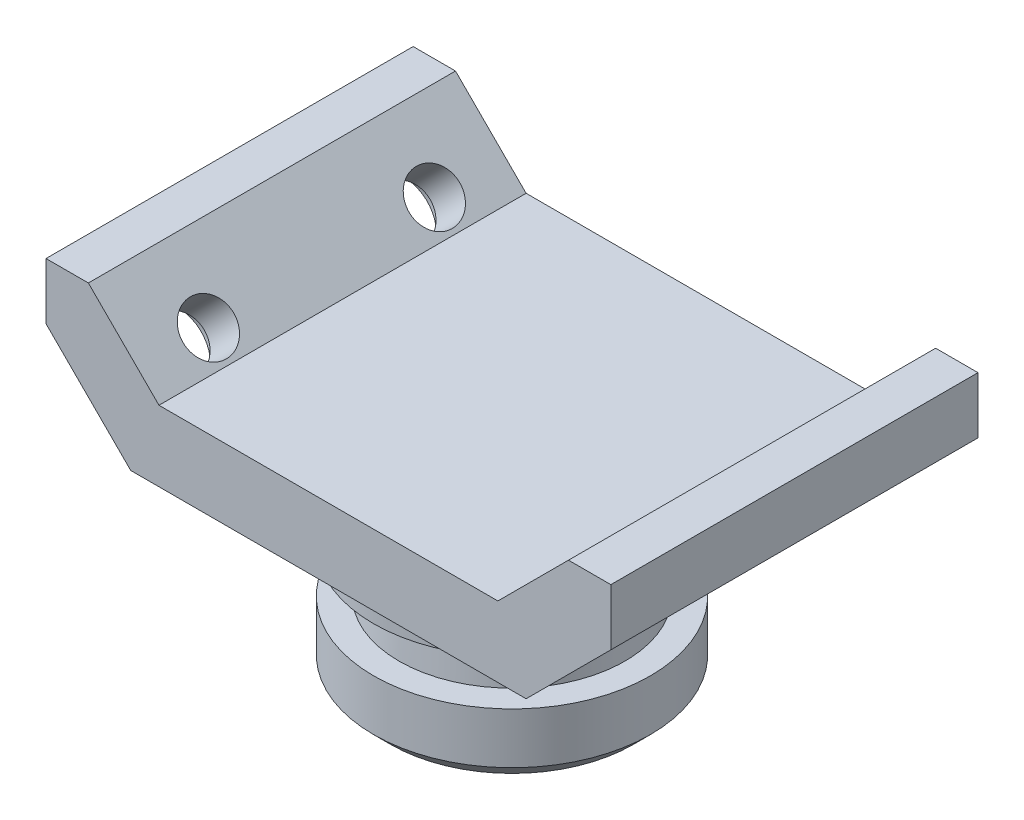
ISO-10303-21;
HEADER;
FILE_DESCRIPTION(('STEP AP214'),'2;1');
FILE_NAME('part.step','',(''),(''),'','','');
FILE_SCHEMA(('AUTOMOTIVE_DESIGN { 1 0 10303 214 1 1 1 1 }'));
ENDSEC;
DATA;
#1=APPLICATION_CONTEXT('core data for automotive mechanical design processes');
#2=APPLICATION_PROTOCOL_DEFINITION('international standard','automotive_design',2000,#1);
#3=PRODUCT_CONTEXT('',#1,'mechanical');
#4=PRODUCT('Part','Part','',(#3));
#5=PRODUCT_RELATED_PRODUCT_CATEGORY('part','',(#4));
#6=PRODUCT_DEFINITION_FORMATION('','',#4);
#7=PRODUCT_DEFINITION_CONTEXT('part definition',#1,'design');
#8=PRODUCT_DEFINITION('design','',#6,#7);
#9=PRODUCT_DEFINITION_SHAPE('','',#8);
#10=(LENGTH_UNIT() NAMED_UNIT(*) SI_UNIT(.MILLI.,.METRE.));
#11=(NAMED_UNIT(*) PLANE_ANGLE_UNIT() SI_UNIT($,.RADIAN.));
#12=(NAMED_UNIT(*) SI_UNIT($,.STERADIAN.) SOLID_ANGLE_UNIT());
#13=UNCERTAINTY_MEASURE_WITH_UNIT(LENGTH_MEASURE(1.E-05),#10,'distance_accuracy_value','');
#14=(GEOMETRIC_REPRESENTATION_CONTEXT(3) GLOBAL_UNCERTAINTY_ASSIGNED_CONTEXT((#13)) GLOBAL_UNIT_ASSIGNED_CONTEXT((#10,
#11,#12)) REPRESENTATION_CONTEXT('',''));
#15=CARTESIAN_POINT('',(0.,0.,0.));
#16=DIRECTION('',(0.,0.,1.));
#17=DIRECTION('',(1.,0.,0.));
#18=AXIS2_PLACEMENT_3D('',#15,#16,#17);
#19=CARTESIAN_POINT('',(30.,0.,32.5));
#20=DIRECTION('',(0.707106781186548,-0.707106781186547,0.));
#21=DIRECTION('',(0.707106781186547,0.707106781186548,0.));
#22=AXIS2_PLACEMENT_3D('',#19,#20,#21);
#23=PLANE('',#22);
#24=CARTESIAN_POINT('',(33.75,3.75,-20.));
#25=DIRECTION('',(0.707106781186548,-0.707106781186547,0.));
#26=DIRECTION('',(0.707106781186547,0.707106781186548,0.));
#27=AXIS2_PLACEMENT_3D('',#24,#25,#26);
#28=CIRCLE('',#27,4.49999999999999);
#29=CARTESIAN_POINT('',(36.9319805153395,6.93198051533945,-20.));
#30=VERTEX_POINT('',#29);
#31=EDGE_CURVE('E36',#30,#30,#28,.T.);
#32=ORIENTED_EDGE('',*,*,#31,.T.);
#33=EDGE_LOOP('',(#32));
#34=FACE_BOUND('',#33,.T.);
#35=CARTESIAN_POINT('',(33.75,3.75,20.));
#36=DIRECTION('',(0.707106781186548,-0.707106781186547,0.));
#37=DIRECTION('',(0.707106781186547,0.707106781186548,0.));
#38=AXIS2_PLACEMENT_3D('',#35,#36,#37);
#39=CIRCLE('',#38,4.49999999999999);
#40=CARTESIAN_POINT('',(36.9319805153395,6.93198051533945,20.));
#41=VERTEX_POINT('',#40);
#42=EDGE_CURVE('E192',#41,#41,#39,.T.);
#43=ORIENTED_EDGE('',*,*,#42,.T.);
#44=EDGE_LOOP('',(#43));
#45=FACE_BOUND('',#44,.T.);
#46=DIRECTION('',(-0.707106781186547,-0.707106781186548,0.));
#47=VECTOR('',#46,1.);
#48=CARTESIAN_POINT('',(30.,0.,-32.5));
#49=LINE('',#48,#47);
#50=CARTESIAN_POINT('',(42.5,12.5,-32.5));
#51=VERTEX_POINT('',#50);
#52=CARTESIAN_POINT('',(30.,0.,-32.5));
#53=VERTEX_POINT('',#52);
#54=EDGE_CURVE('E144',#51,#53,#49,.T.);
#55=ORIENTED_EDGE('',*,*,#54,.T.);
#56=DIRECTION('',(0.,0.,-1.));
#57=VECTOR('',#56,1.);
#58=CARTESIAN_POINT('',(30.,0.,32.5));
#59=LINE('',#58,#57);
#60=CARTESIAN_POINT('',(30.,0.,32.5));
#61=VERTEX_POINT('',#60);
#62=EDGE_CURVE('E42',#61,#53,#59,.T.);
#63=ORIENTED_EDGE('',*,*,#62,.F.);
#64=DIRECTION('',(-0.707106781186547,-0.707106781186548,0.));
#65=VECTOR('',#64,1.);
#66=CARTESIAN_POINT('',(30.,0.,32.5));
#67=LINE('',#66,#65);
#68=CARTESIAN_POINT('',(42.5,12.5,32.5));
#69=VERTEX_POINT('',#68);
#70=EDGE_CURVE('E163',#69,#61,#67,.T.);
#71=ORIENTED_EDGE('',*,*,#70,.F.);
#72=DIRECTION('',(0.,0.,-1.));
#73=VECTOR('',#72,1.);
#74=CARTESIAN_POINT('',(42.5,12.5,32.5));
#75=LINE('',#74,#73);
#76=EDGE_CURVE('E140',#69,#51,#75,.T.);
#77=ORIENTED_EDGE('',*,*,#76,.T.);
#78=EDGE_LOOP('',(#55,#63,#71,#77));
#79=FACE_BOUND('',#78,.T.);
#80=ADVANCED_FACE('F33',(#34,#45,#79),#23,.F.);
#81=CARTESIAN_POINT('',(-30.,0.,32.5));
#82=DIRECTION('',(0.,-1.,0.));
#83=DIRECTION('',(1.,0.,0.));
#84=AXIS2_PLACEMENT_3D('',#81,#82,#83);
#85=PLANE('',#84);
#86=DIRECTION('',(-1.,0.,0.));
#87=VECTOR('',#86,1.);
#88=CARTESIAN_POINT('',(-30.,0.,-32.5));
#89=LINE('',#88,#87);
#90=CARTESIAN_POINT('',(-30.,0.,-32.5));
#91=VERTEX_POINT('',#90);
#92=EDGE_CURVE('E147',#53,#91,#89,.T.);
#93=ORIENTED_EDGE('',*,*,#92,.T.);
#94=DIRECTION('',(0.,0.,-1.));
#95=VECTOR('',#94,1.);
#96=CARTESIAN_POINT('',(-30.,0.,32.5));
#97=LINE('',#96,#95);
#98=CARTESIAN_POINT('',(-30.,0.,32.5));
#99=VERTEX_POINT('',#98);
#100=EDGE_CURVE('E179',#99,#91,#97,.T.);
#101=ORIENTED_EDGE('',*,*,#100,.F.);
#102=DIRECTION('',(-1.,0.,0.));
#103=VECTOR('',#102,1.);
#104=CARTESIAN_POINT('',(-30.,0.,32.5));
#105=LINE('',#104,#103);
#106=EDGE_CURVE('E101',#61,#99,#105,.T.);
#107=ORIENTED_EDGE('',*,*,#106,.F.);
#108=ORIENTED_EDGE('',*,*,#62,.T.);
#109=EDGE_LOOP('',(#93,#101,#107,#108));
#110=FACE_BOUND('',#109,.T.);
#111=ADVANCED_FACE('F275',(#110),#85,.F.);
#112=CARTESIAN_POINT('',(-30.,0.,32.5));
#113=DIRECTION('',(-0.707106781186547,-0.707106781186548,0.));
#114=DIRECTION('',(0.707106781186548,-0.707106781186547,0.));
#115=AXIS2_PLACEMENT_3D('',#112,#113,#114);
#116=PLANE('',#115);
#117=CARTESIAN_POINT('',(-33.75,3.74999999999999,-20.));
#118=DIRECTION('',(-0.707106781186547,-0.707106781186548,0.));
#119=DIRECTION('',(0.707106781186548,-0.707106781186547,0.));
#120=AXIS2_PLACEMENT_3D('',#117,#118,#119);
#121=CIRCLE('',#120,4.49999999999999);
#122=CARTESIAN_POINT('',(-30.5680194846605,0.568019484660539,-20.));
#123=VERTEX_POINT('',#122);
#124=EDGE_CURVE('E188',#123,#123,#121,.T.);
#125=ORIENTED_EDGE('',*,*,#124,.T.);
#126=EDGE_LOOP('',(#125));
#127=FACE_BOUND('',#126,.T.);
#128=CARTESIAN_POINT('',(-33.75,3.74999999999999,20.));
#129=DIRECTION('',(-0.707106781186547,-0.707106781186548,0.));
#130=DIRECTION('',(0.707106781186548,-0.707106781186547,0.));
#131=AXIS2_PLACEMENT_3D('',#128,#129,#130);
#132=CIRCLE('',#131,4.49999999999999);
#133=CARTESIAN_POINT('',(-30.5680194846605,0.568019484660539,20.));
#134=VERTEX_POINT('',#133);
#135=EDGE_CURVE('E183',#134,#134,#132,.T.);
#136=ORIENTED_EDGE('',*,*,#135,.T.);
#137=EDGE_LOOP('',(#136));
#138=FACE_BOUND('',#137,.T.);
#139=DIRECTION('',(-0.707106781186547,0.707106781186547,0.));
#140=VECTOR('',#139,1.);
#141=CARTESIAN_POINT('',(-30.,0.,-32.5));
#142=LINE('',#141,#140);
#143=CARTESIAN_POINT('',(-42.5,12.5,-32.5));
#144=VERTEX_POINT('',#143);
#145=EDGE_CURVE('E150',#91,#144,#142,.T.);
#146=ORIENTED_EDGE('',*,*,#145,.T.);
#147=DIRECTION('',(0.,0.,-1.));
#148=VECTOR('',#147,1.);
#149=CARTESIAN_POINT('',(-42.5,12.5,32.5));
#150=LINE('',#149,#148);
#151=CARTESIAN_POINT('',(-42.5,12.5,32.5));
#152=VERTEX_POINT('',#151);
#153=EDGE_CURVE('E176',#152,#144,#150,.T.);
#154=ORIENTED_EDGE('',*,*,#153,.F.);
#155=DIRECTION('',(-0.707106781186547,0.707106781186547,0.));
#156=VECTOR('',#155,1.);
#157=CARTESIAN_POINT('',(-30.,0.,32.5));
#158=LINE('',#157,#156);
#159=EDGE_CURVE('E240',#99,#152,#158,.T.);
#160=ORIENTED_EDGE('',*,*,#159,.F.);
#161=ORIENTED_EDGE('',*,*,#100,.T.);
#162=EDGE_LOOP('',(#146,#154,#160,#161));
#163=FACE_BOUND('',#162,.T.);
#164=ADVANCED_FACE('F280',(#127,#138,#163),#116,.F.);
#165=CARTESIAN_POINT('',(-42.5,12.5,32.5));
#166=DIRECTION('',(0.,-1.,0.));
#167=DIRECTION('',(1.,0.,0.));
#168=AXIS2_PLACEMENT_3D('',#165,#166,#167);
#169=PLANE('',#168);
#170=DIRECTION('',(-1.,0.,0.));
#171=VECTOR('',#170,1.);
#172=CARTESIAN_POINT('',(-42.5,12.5,-32.5));
#173=LINE('',#172,#171);
#174=CARTESIAN_POINT('',(-50.,12.5,-32.5));
#175=VERTEX_POINT('',#174);
#176=EDGE_CURVE('E152',#144,#175,#173,.T.);
#177=ORIENTED_EDGE('',*,*,#176,.T.);
#178=DIRECTION('',(0.,0.,-1.));
#179=VECTOR('',#178,1.);
#180=CARTESIAN_POINT('',(-50.,12.5,32.5));
#181=LINE('',#180,#179);
#182=CARTESIAN_POINT('',(-50.,12.5,32.5));
#183=VERTEX_POINT('',#182);
#184=EDGE_CURVE('E173',#183,#175,#181,.T.);
#185=ORIENTED_EDGE('',*,*,#184,.F.);
#186=DIRECTION('',(-1.,0.,0.));
#187=VECTOR('',#186,1.);
#188=CARTESIAN_POINT('',(-42.5,12.5,32.5));
#189=LINE('',#188,#187);
#190=EDGE_CURVE('E242',#152,#183,#189,.T.);
#191=ORIENTED_EDGE('',*,*,#190,.F.);
#192=ORIENTED_EDGE('',*,*,#153,.T.);
#193=EDGE_LOOP('',(#177,#185,#191,#192));
#194=FACE_BOUND('',#193,.T.);
#195=ADVANCED_FACE('F546',(#194),#169,.F.);
#196=CARTESIAN_POINT('',(-50.,12.5,32.5));
#197=DIRECTION('',(1.,0.,0.));
#198=DIRECTION('',(0.,1.,0.));
#199=AXIS2_PLACEMENT_3D('',#196,#197,#198);
#200=PLANE('',#199);
#201=DIRECTION('',(0.,-1.,0.));
#202=VECTOR('',#201,1.);
#203=CARTESIAN_POINT('',(-50.,12.5,-32.5));
#204=LINE('',#203,#202);
#205=CARTESIAN_POINT('',(-50.,2.49999999999996,-32.5));
#206=VERTEX_POINT('',#205);
#207=EDGE_CURVE('E154',#175,#206,#204,.T.);
#208=ORIENTED_EDGE('',*,*,#207,.T.);
#209=DIRECTION('',(0.,0.,-1.));
#210=VECTOR('',#209,1.);
#211=CARTESIAN_POINT('',(-50.,2.49999999999996,32.5));
#212=LINE('',#211,#210);
#213=CARTESIAN_POINT('',(-50.,2.49999999999996,32.5));
#214=VERTEX_POINT('',#213);
#215=EDGE_CURVE('E170',#214,#206,#212,.T.);
#216=ORIENTED_EDGE('',*,*,#215,.F.);
#217=DIRECTION('',(0.,-1.,0.));
#218=VECTOR('',#217,1.);
#219=CARTESIAN_POINT('',(-50.,12.5,32.5));
#220=LINE('',#219,#218);
#221=EDGE_CURVE('E244',#183,#214,#220,.T.);
#222=ORIENTED_EDGE('',*,*,#221,.F.);
#223=ORIENTED_EDGE('',*,*,#184,.T.);
#224=EDGE_LOOP('',(#208,#216,#222,#223));
#225=FACE_BOUND('',#224,.T.);
#226=ADVANCED_FACE('F538',(#225),#200,.F.);
#227=CARTESIAN_POINT('',(-50.,2.49999999999996,32.5));
#228=DIRECTION('',(0.707106781186547,0.707106781186548,0.));
#229=DIRECTION('',(-0.707106781186548,0.707106781186547,0.));
#230=AXIS2_PLACEMENT_3D('',#227,#228,#229);
#231=PLANE('',#230);
#232=CARTESIAN_POINT('',(-42.5,-5.00000000000002,-20.));
#233=DIRECTION('',(-0.707106781186547,-0.707106781186548,0.));
#234=DIRECTION('',(0.707106781186548,-0.707106781186547,0.));
#235=AXIS2_PLACEMENT_3D('',#232,#233,#234);
#236=CIRCLE('',#235,7.5);
#237=CARTESIAN_POINT('',(-37.1966991411009,-10.3033008588991,-20.));
#238=VERTEX_POINT('',#237);
#239=EDGE_CURVE('E194',#238,#238,#236,.T.);
#240=ORIENTED_EDGE('',*,*,#239,.F.);
#241=EDGE_LOOP('',(#240));
#242=FACE_BOUND('',#241,.T.);
#243=CARTESIAN_POINT('',(-42.5,-5.00000000000002,20.));
#244=DIRECTION('',(-0.707106781186547,-0.707106781186548,0.));
#245=DIRECTION('',(0.707106781186548,-0.707106781186547,0.));
#246=AXIS2_PLACEMENT_3D('',#243,#244,#245);
#247=CIRCLE('',#246,7.5);
#248=CARTESIAN_POINT('',(-37.1966991411009,-10.3033008588991,20.));
#249=VERTEX_POINT('',#248);
#250=EDGE_CURVE('E190',#249,#249,#247,.T.);
#251=ORIENTED_EDGE('',*,*,#250,.F.);
#252=EDGE_LOOP('',(#251));
#253=FACE_BOUND('',#252,.T.);
#254=DIRECTION('',(0.707106781186548,-0.707106781186547,0.));
#255=VECTOR('',#254,1.);
#256=CARTESIAN_POINT('',(-50.,2.49999999999996,-32.5));
#257=LINE('',#256,#255);
#258=CARTESIAN_POINT('',(-35.,-12.5,-32.5));
#259=VERTEX_POINT('',#258);
#260=EDGE_CURVE('E156',#206,#259,#257,.T.);
#261=ORIENTED_EDGE('',*,*,#260,.T.);
#262=DIRECTION('',(0.,0.,-1.));
#263=VECTOR('',#262,1.);
#264=CARTESIAN_POINT('',(-35.,-12.5,32.5));
#265=LINE('',#264,#263);
#266=CARTESIAN_POINT('',(-35.,-12.5,32.5));
#267=VERTEX_POINT('',#266);
#268=EDGE_CURVE('E167',#267,#259,#265,.T.);
#269=ORIENTED_EDGE('',*,*,#268,.F.);
#270=DIRECTION('',(0.707106781186548,-0.707106781186547,0.));
#271=VECTOR('',#270,1.);
#272=CARTESIAN_POINT('',(-50.,2.49999999999996,32.5));
#273=LINE('',#272,#271);
#274=EDGE_CURVE('E246',#214,#267,#273,.T.);
#275=ORIENTED_EDGE('',*,*,#274,.F.);
#276=ORIENTED_EDGE('',*,*,#215,.T.);
#277=EDGE_LOOP('',(#261,#269,#275,#276));
#278=FACE_BOUND('',#277,.T.);
#279=ADVANCED_FACE('F252',(#242,#253,#278),#231,.F.);
#280=CARTESIAN_POINT('',(-35.,-12.5,32.5));
#281=DIRECTION('',(0.,1.,0.));
#282=DIRECTION('',(-1.,0.,0.));
#283=AXIS2_PLACEMENT_3D('',#280,#281,#282);
#284=PLANE('',#283);
#285=CARTESIAN_POINT('',(0.,-12.5,0.));
#286=DIRECTION('',(0.,1.,0.));
#287=DIRECTION('',(-1.,0.,0.));
#288=AXIS2_PLACEMENT_3D('',#285,#286,#287);
#289=CIRCLE('',#288,24.5);
#290=CARTESIAN_POINT('',(-24.5,-12.5,0.));
#291=VERTEX_POINT('',#290);
#292=EDGE_CURVE('E11',#291,#291,#289,.F.);
#293=ORIENTED_EDGE('',*,*,#292,.F.);
#294=EDGE_LOOP('',(#293));
#295=FACE_BOUND('',#294,.T.);
#296=DIRECTION('',(1.,0.,0.));
#297=VECTOR('',#296,1.);
#298=CARTESIAN_POINT('',(-35.,-12.5,-32.5));
#299=LINE('',#298,#297);
#300=CARTESIAN_POINT('',(35.,-12.5,-32.5));
#301=VERTEX_POINT('',#300);
#302=EDGE_CURVE('E158',#259,#301,#299,.T.);
#303=ORIENTED_EDGE('',*,*,#302,.T.);
#304=DIRECTION('',(0.,0.,-1.));
#305=VECTOR('',#304,1.);
#306=CARTESIAN_POINT('',(35.,-12.5,32.5));
#307=LINE('',#306,#305);
#308=CARTESIAN_POINT('',(35.,-12.5,32.5));
#309=VERTEX_POINT('',#308);
#310=EDGE_CURVE('E135',#309,#301,#307,.T.);
#311=ORIENTED_EDGE('',*,*,#310,.F.);
#312=DIRECTION('',(1.,0.,0.));
#313=VECTOR('',#312,1.);
#314=CARTESIAN_POINT('',(-35.,-12.5,32.5));
#315=LINE('',#314,#313);
#316=EDGE_CURVE('E126',#267,#309,#315,.T.);
#317=ORIENTED_EDGE('',*,*,#316,.F.);
#318=ORIENTED_EDGE('',*,*,#268,.T.);
#319=EDGE_LOOP('',(#303,#311,#317,#318));
#320=FACE_BOUND('',#319,.T.);
#321=ADVANCED_FACE('F256',(#295,#320),#284,.F.);
#322=CARTESIAN_POINT('',(50.,2.49999999999998,32.5));
#323=DIRECTION('',(-0.707106781186547,0.707106781186548,0.));
#324=DIRECTION('',(-0.707106781186548,-0.707106781186547,0.));
#325=AXIS2_PLACEMENT_3D('',#322,#323,#324);
#326=PLANE('',#325);
#327=CARTESIAN_POINT('',(42.5,-5.00000000000001,-20.));
#328=DIRECTION('',(0.707106781186547,-0.707106781186548,0.));
#329=DIRECTION('',(0.707106781186548,0.707106781186547,0.));
#330=AXIS2_PLACEMENT_3D('',#327,#328,#329);
#331=CIRCLE('',#330,7.5);
#332=CARTESIAN_POINT('',(47.8033008588991,0.303300858899093,-20.));
#333=VERTEX_POINT('',#332);
#334=EDGE_CURVE('E292',#333,#333,#331,.T.);
#335=ORIENTED_EDGE('',*,*,#334,.F.);
#336=EDGE_LOOP('',(#335));
#337=FACE_BOUND('',#336,.T.);
#338=CARTESIAN_POINT('',(42.5,-5.00000000000001,20.));
#339=DIRECTION('',(0.707106781186547,-0.707106781186548,0.));
#340=DIRECTION('',(0.707106781186548,0.707106781186547,0.));
#341=AXIS2_PLACEMENT_3D('',#338,#339,#340);
#342=CIRCLE('',#341,7.5);
#343=CARTESIAN_POINT('',(47.8033008588991,0.303300858899093,20.));
#344=VERTEX_POINT('',#343);
#345=EDGE_CURVE('E207',#344,#344,#342,.T.);
#346=ORIENTED_EDGE('',*,*,#345,.F.);
#347=EDGE_LOOP('',(#346));
#348=FACE_BOUND('',#347,.T.);
#349=DIRECTION('',(0.707106781186548,0.707106781186547,0.));
#350=VECTOR('',#349,1.);
#351=CARTESIAN_POINT('',(50.,2.49999999999998,-32.5));
#352=LINE('',#351,#350);
#353=CARTESIAN_POINT('',(50.,2.49999999999998,-32.5));
#354=VERTEX_POINT('',#353);
#355=EDGE_CURVE('E134',#301,#354,#352,.T.);
#356=ORIENTED_EDGE('',*,*,#355,.T.);
#357=DIRECTION('',(0.,0.,-1.));
#358=VECTOR('',#357,1.);
#359=CARTESIAN_POINT('',(50.,2.49999999999998,32.5));
#360=LINE('',#359,#358);
#361=CARTESIAN_POINT('',(50.,2.49999999999998,32.5));
#362=VERTEX_POINT('',#361);
#363=EDGE_CURVE('E131',#362,#354,#360,.T.);
#364=ORIENTED_EDGE('',*,*,#363,.F.);
#365=DIRECTION('',(0.707106781186548,0.707106781186547,0.));
#366=VECTOR('',#365,1.);
#367=CARTESIAN_POINT('',(50.,2.49999999999998,32.5));
#368=LINE('',#367,#366);
#369=EDGE_CURVE('E120',#309,#362,#368,.T.);
#370=ORIENTED_EDGE('',*,*,#369,.F.);
#371=ORIENTED_EDGE('',*,*,#310,.T.);
#372=EDGE_LOOP('',(#356,#364,#370,#371));
#373=FACE_BOUND('',#372,.T.);
#374=ADVANCED_FACE('F132',(#337,#348,#373),#326,.F.);
#375=CARTESIAN_POINT('',(50.,12.5,32.5));
#376=DIRECTION('',(-1.,0.,0.));
#377=DIRECTION('',(0.,-1.,0.));
#378=AXIS2_PLACEMENT_3D('',#375,#376,#377);
#379=PLANE('',#378);
#380=DIRECTION('',(0.,1.,0.));
#381=VECTOR('',#380,1.);
#382=CARTESIAN_POINT('',(50.,12.5,-32.5));
#383=LINE('',#382,#381);
#384=CARTESIAN_POINT('',(50.,12.5,-32.5));
#385=VERTEX_POINT('',#384);
#386=EDGE_CURVE('E86',#354,#385,#383,.T.);
#387=ORIENTED_EDGE('',*,*,#386,.T.);
#388=DIRECTION('',(0.,0.,-1.));
#389=VECTOR('',#388,1.);
#390=CARTESIAN_POINT('',(50.,12.5,32.5));
#391=LINE('',#390,#389);
#392=CARTESIAN_POINT('',(50.,12.5,32.5));
#393=VERTEX_POINT('',#392);
#394=EDGE_CURVE('E136',#393,#385,#391,.T.);
#395=ORIENTED_EDGE('',*,*,#394,.F.);
#396=DIRECTION('',(0.,1.,0.));
#397=VECTOR('',#396,1.);
#398=CARTESIAN_POINT('',(50.,12.5,32.5));
#399=LINE('',#398,#397);
#400=EDGE_CURVE('E124',#362,#393,#399,.T.);
#401=ORIENTED_EDGE('',*,*,#400,.F.);
#402=ORIENTED_EDGE('',*,*,#363,.T.);
#403=EDGE_LOOP('',(#387,#395,#401,#402));
#404=FACE_BOUND('',#403,.T.);
#405=ADVANCED_FACE('F138',(#404),#379,.F.);
#406=CARTESIAN_POINT('',(42.5,12.5,32.5));
#407=DIRECTION('',(0.,-1.,0.));
#408=DIRECTION('',(0.,0.,-1.));
#409=AXIS2_PLACEMENT_3D('',#406,#407,#408);
#410=PLANE('',#409);
#411=DIRECTION('',(-1.,0.,0.));
#412=VECTOR('',#411,1.);
#413=CARTESIAN_POINT('',(42.5,12.5,-32.5));
#414=LINE('',#413,#412);
#415=EDGE_CURVE('E92',#385,#51,#414,.T.);
#416=ORIENTED_EDGE('',*,*,#415,.T.);
#417=ORIENTED_EDGE('',*,*,#76,.F.);
#418=DIRECTION('',(-1.,0.,0.));
#419=VECTOR('',#418,1.);
#420=CARTESIAN_POINT('',(42.5,12.5,32.5));
#421=LINE('',#420,#419);
#422=EDGE_CURVE('E51',#393,#69,#421,.T.);
#423=ORIENTED_EDGE('',*,*,#422,.F.);
#424=ORIENTED_EDGE('',*,*,#394,.T.);
#425=EDGE_LOOP('',(#416,#417,#423,#424));
#426=FACE_BOUND('',#425,.T.);
#427=ADVANCED_FACE('F264',(#426),#410,.F.);
#428=CARTESIAN_POINT('',(0.,0.,32.5));
#429=DIRECTION('',(0.,0.,-1.));
#430=DIRECTION('',(-1.,0.,0.));
#431=AXIS2_PLACEMENT_3D('',#428,#429,#430);
#432=PLANE('',#431);
#433=ORIENTED_EDGE('',*,*,#70,.T.);
#434=ORIENTED_EDGE('',*,*,#106,.T.);
#435=ORIENTED_EDGE('',*,*,#159,.T.);
#436=ORIENTED_EDGE('',*,*,#190,.T.);
#437=ORIENTED_EDGE('',*,*,#221,.T.);
#438=ORIENTED_EDGE('',*,*,#274,.T.);
#439=ORIENTED_EDGE('',*,*,#316,.T.);
#440=ORIENTED_EDGE('',*,*,#369,.T.);
#441=ORIENTED_EDGE('',*,*,#400,.T.);
#442=ORIENTED_EDGE('',*,*,#422,.T.);
#443=EDGE_LOOP('',(#433,#434,#435,#436,#437,#438,#439,#440,#441,#442));
#444=FACE_BOUND('',#443,.T.);
#445=ADVANCED_FACE('F122',(#444),#432,.F.);
#446=CARTESIAN_POINT('',(0.,0.,-32.5));
#447=DIRECTION('',(0.,0.,-1.));
#448=DIRECTION('',(-1.,0.,0.));
#449=AXIS2_PLACEMENT_3D('',#446,#447,#448);
#450=PLANE('',#449);
#451=ORIENTED_EDGE('',*,*,#54,.F.);
#452=ORIENTED_EDGE('',*,*,#415,.F.);
#453=ORIENTED_EDGE('',*,*,#386,.F.);
#454=ORIENTED_EDGE('',*,*,#355,.F.);
#455=ORIENTED_EDGE('',*,*,#302,.F.);
#456=ORIENTED_EDGE('',*,*,#260,.F.);
#457=ORIENTED_EDGE('',*,*,#207,.F.);
#458=ORIENTED_EDGE('',*,*,#176,.F.);
#459=ORIENTED_EDGE('',*,*,#145,.F.);
#460=ORIENTED_EDGE('',*,*,#92,.F.);
#461=EDGE_LOOP('',(#451,#452,#453,#454,#455,#456,#457,#458,#459,#460));
#462=FACE_BOUND('',#461,.T.);
#463=ADVANCED_FACE('F259',(#462),#450,.T.);
#464=CARTESIAN_POINT('',(0.,-42.5,0.));
#465=DIRECTION('',(0.,-1.,0.));
#466=DIRECTION('',(0.,0.,-1.));
#467=AXIS2_PLACEMENT_3D('',#464,#465,#466);
#468=CYLINDRICAL_SURFACE('',#467,24.5);
#469=CARTESIAN_POINT('',(0.,-22.5,0.));
#470=DIRECTION('',(0.,-1.,0.));
#471=DIRECTION('',(0.,0.,-1.));
#472=AXIS2_PLACEMENT_3D('',#469,#470,#471);
#473=CIRCLE('',#472,24.5);
#474=CARTESIAN_POINT('',(0.,-22.5,-24.5));
#475=VERTEX_POINT('',#474);
#476=EDGE_CURVE('E148',#475,#475,#473,.T.);
#477=ORIENTED_EDGE('',*,*,#476,.F.);
#478=EDGE_LOOP('',(#477));
#479=FACE_BOUND('',#478,.T.);
#480=ORIENTED_EDGE('',*,*,#292,.T.);
#481=EDGE_LOOP('',(#480));
#482=FACE_BOUND('',#481,.T.);
#483=ADVANCED_FACE('F372',(#479,#482),#468,.T.);
#484=CARTESIAN_POINT('',(-24.5,-22.5,0.));
#485=DIRECTION('',(0.,1.,0.));
#486=DIRECTION('',(0.,0.,1.));
#487=AXIS2_PLACEMENT_3D('',#484,#485,#486);
#488=PLANE('',#487);
#489=CARTESIAN_POINT('',(0.,-22.5,0.));
#490=DIRECTION('',(0.,-1.,0.));
#491=DIRECTION('',(0.,0.,-1.));
#492=AXIS2_PLACEMENT_3D('',#489,#490,#491);
#493=CIRCLE('',#492,19.5);
#494=CARTESIAN_POINT('',(0.,-22.5,-19.5));
#495=VERTEX_POINT('',#494);
#496=EDGE_CURVE('E233',#495,#495,#493,.T.);
#497=ORIENTED_EDGE('',*,*,#496,.F.);
#498=EDGE_LOOP('',(#497));
#499=FACE_BOUND('',#498,.T.);
#500=ORIENTED_EDGE('',*,*,#476,.T.);
#501=EDGE_LOOP('',(#500));
#502=FACE_BOUND('',#501,.T.);
#503=ADVANCED_FACE('F368',(#499,#502),#488,.F.);
#504=CARTESIAN_POINT('',(0.,-22.5,0.));
#505=DIRECTION('',(0.,-1.,0.));
#506=DIRECTION('',(0.,0.,-1.));
#507=AXIS2_PLACEMENT_3D('',#504,#505,#506);
#508=CONICAL_SURFACE('',#507,19.5,0.0625407617964854);
#509=CARTESIAN_POINT('',(0.,-30.4843597113356,0.));
#510=DIRECTION('',(0.,-1.,0.));
#511=DIRECTION('',(0.,0.,-1.));
#512=AXIS2_PLACEMENT_3D('',#509,#510,#511);
#513=CIRCLE('',#512,20.);
#514=CARTESIAN_POINT('',(0.,-30.4843597113356,-20.));
#515=VERTEX_POINT('',#514);
#516=EDGE_CURVE('E230',#515,#515,#513,.T.);
#517=ORIENTED_EDGE('',*,*,#516,.F.);
#518=EDGE_LOOP('',(#517));
#519=FACE_BOUND('',#518,.T.);
#520=ORIENTED_EDGE('',*,*,#496,.T.);
#521=EDGE_LOOP('',(#520));
#522=FACE_BOUND('',#521,.T.);
#523=ADVANCED_FACE('F364',(#519,#522),#508,.T.);
#524=CARTESIAN_POINT('',(-20.,-30.4843597113356,0.));
#525=DIRECTION('',(0.,-1.,0.));
#526=DIRECTION('',(0.,0.,-1.));
#527=AXIS2_PLACEMENT_3D('',#524,#525,#526);
#528=PLANE('',#527);
#529=CARTESIAN_POINT('',(0.,-30.4843597113356,0.));
#530=DIRECTION('',(0.,-1.,0.));
#531=DIRECTION('',(0.,0.,-1.));
#532=AXIS2_PLACEMENT_3D('',#529,#530,#531);
#533=CIRCLE('',#532,24.5);
#534=CARTESIAN_POINT('',(0.,-30.4843597113356,-24.5));
#535=VERTEX_POINT('',#534);
#536=EDGE_CURVE('E227',#535,#535,#533,.T.);
#537=ORIENTED_EDGE('',*,*,#536,.F.);
#538=EDGE_LOOP('',(#537));
#539=FACE_BOUND('',#538,.T.);
#540=ORIENTED_EDGE('',*,*,#516,.T.);
#541=EDGE_LOOP('',(#540));
#542=FACE_BOUND('',#541,.T.);
#543=ADVANCED_FACE('F360',(#539,#542),#528,.F.);
#544=CARTESIAN_POINT('',(0.,-42.5,0.));
#545=DIRECTION('',(0.,-1.,0.));
#546=DIRECTION('',(0.,0.,-1.));
#547=AXIS2_PLACEMENT_3D('',#544,#545,#546);
#548=CYLINDRICAL_SURFACE('',#547,24.5);
#549=CARTESIAN_POINT('',(0.,-39.5,0.));
#550=DIRECTION('',(0.,-1.,0.));
#551=DIRECTION('',(0.,0.,-1.));
#552=AXIS2_PLACEMENT_3D('',#549,#550,#551);
#553=CIRCLE('',#552,24.5);
#554=CARTESIAN_POINT('',(0.,-39.5,-24.5));
#555=VERTEX_POINT('',#554);
#556=EDGE_CURVE('E224',#555,#555,#553,.T.);
#557=ORIENTED_EDGE('',*,*,#556,.F.);
#558=EDGE_LOOP('',(#557));
#559=FACE_BOUND('',#558,.T.);
#560=ORIENTED_EDGE('',*,*,#536,.T.);
#561=EDGE_LOOP('',(#560));
#562=FACE_BOUND('',#561,.T.);
#563=ADVANCED_FACE('F356',(#559,#562),#548,.T.);
#564=CARTESIAN_POINT('',(0.,-39.5,0.));
#565=DIRECTION('',(0.,1.,0.));
#566=DIRECTION('',(0.,0.,1.));
#567=AXIS2_PLACEMENT_3D('',#564,#565,#566);
#568=CONICAL_SURFACE('',#567,24.5,0.785398163397446);
#569=CARTESIAN_POINT('',(0.,-42.5,0.));
#570=DIRECTION('',(0.,-1.,0.));
#571=DIRECTION('',(0.,0.,-1.));
#572=AXIS2_PLACEMENT_3D('',#569,#570,#571);
#573=CIRCLE('',#572,21.5);
#574=CARTESIAN_POINT('',(0.,-42.5,-21.5));
#575=VERTEX_POINT('',#574);
#576=EDGE_CURVE('E186',#575,#575,#573,.T.);
#577=ORIENTED_EDGE('',*,*,#576,.F.);
#578=EDGE_LOOP('',(#577));
#579=FACE_BOUND('',#578,.T.);
#580=ORIENTED_EDGE('',*,*,#556,.T.);
#581=EDGE_LOOP('',(#580));
#582=FACE_BOUND('',#581,.T.);
#583=ADVANCED_FACE('F352',(#579,#582),#568,.T.);
#584=CARTESIAN_POINT('',(-21.5,-42.5,0.));
#585=DIRECTION('',(0.,1.,0.));
#586=DIRECTION('',(0.,0.,1.));
#587=AXIS2_PLACEMENT_3D('',#584,#585,#586);
#588=PLANE('',#587);
#589=ORIENTED_EDGE('',*,*,#576,.T.);
#590=EDGE_LOOP('',(#589));
#591=FACE_BOUND('',#590,.T.);
#592=ADVANCED_FACE('F348',(#591),#588,.F.);
#593=CARTESIAN_POINT('',(-42.5,-5.00000000000002,20.));
#594=DIRECTION('',(-0.707106781186547,-0.707106781186548,0.));
#595=DIRECTION('',(0.707106781186548,-0.707106781186547,0.));
#596=AXIS2_PLACEMENT_3D('',#593,#594,#595);
#597=CYLINDRICAL_SURFACE('',#596,4.49999999999999);
#598=CARTESIAN_POINT('',(-38.9644660940673,-1.46446609406728,20.));
#599=DIRECTION('',(-0.707106781186547,-0.707106781186548,0.));
#600=DIRECTION('',(0.707106781186548,-0.707106781186547,0.));
#601=AXIS2_PLACEMENT_3D('',#598,#599,#600);
#602=CIRCLE('',#601,4.5);
#603=CARTESIAN_POINT('',(-35.7824855787278,-4.64644660940674,20.));
#604=VERTEX_POINT('',#603);
#605=EDGE_CURVE('E187',#604,#604,#602,.T.);
#606=ORIENTED_EDGE('',*,*,#605,.T.);
#607=EDGE_LOOP('',(#606));
#608=FACE_BOUND('',#607,.T.);
#609=ORIENTED_EDGE('',*,*,#135,.F.);
#610=EDGE_LOOP('',(#609));
#611=FACE_BOUND('',#610,.T.);
#612=ADVANCED_FACE('F344',(#608,#611),#597,.F.);
#613=CARTESIAN_POINT('',(-38.9644660940673,-1.46446609406728,24.5));
#614=DIRECTION('',(0.707106781186547,0.707106781186548,0.));
#615=DIRECTION('',(-0.707106781186548,0.707106781186547,0.));
#616=AXIS2_PLACEMENT_3D('',#613,#614,#615);
#617=PLANE('',#616);
#618=ORIENTED_EDGE('',*,*,#605,.F.);
#619=EDGE_LOOP('',(#618));
#620=FACE_BOUND('',#619,.T.);
#621=CARTESIAN_POINT('',(-38.9644660940673,-1.46446609406728,20.));
#622=DIRECTION('',(-0.707106781186547,-0.707106781186548,0.));
#623=DIRECTION('',(0.707106781186548,-0.707106781186547,0.));
#624=AXIS2_PLACEMENT_3D('',#621,#622,#623);
#625=CIRCLE('',#624,7.5);
#626=CARTESIAN_POINT('',(-33.6611652351682,-6.76776695296638,20.));
#627=VERTEX_POINT('',#626);
#628=EDGE_CURVE('E217',#627,#627,#625,.T.);
#629=ORIENTED_EDGE('',*,*,#628,.T.);
#630=EDGE_LOOP('',(#629));
#631=FACE_BOUND('',#630,.T.);
#632=ADVANCED_FACE('F340',(#620,#631),#617,.F.);
#633=CARTESIAN_POINT('',(-42.5,-5.00000000000002,20.));
#634=DIRECTION('',(-0.707106781186547,-0.707106781186548,0.));
#635=DIRECTION('',(0.707106781186548,-0.707106781186547,0.));
#636=AXIS2_PLACEMENT_3D('',#633,#634,#635);
#637=CYLINDRICAL_SURFACE('',#636,7.5);
#638=ORIENTED_EDGE('',*,*,#628,.F.);
#639=EDGE_LOOP('',(#638));
#640=FACE_BOUND('',#639,.T.);
#641=ORIENTED_EDGE('',*,*,#250,.T.);
#642=EDGE_LOOP('',(#641));
#643=FACE_BOUND('',#642,.T.);
#644=ADVANCED_FACE('F336',(#640,#643),#637,.F.);
#645=CARTESIAN_POINT('',(-42.5,-5.00000000000002,-20.));
#646=DIRECTION('',(-0.707106781186547,-0.707106781186548,0.));
#647=DIRECTION('',(0.707106781186548,-0.707106781186547,0.));
#648=AXIS2_PLACEMENT_3D('',#645,#646,#647);
#649=CYLINDRICAL_SURFACE('',#648,4.49999999999999);
#650=CARTESIAN_POINT('',(-38.9644660940673,-1.46446609406728,-20.));
#651=DIRECTION('',(-0.707106781186547,-0.707106781186548,0.));
#652=DIRECTION('',(0.707106781186548,-0.707106781186547,0.));
#653=AXIS2_PLACEMENT_3D('',#650,#651,#652);
#654=CIRCLE('',#653,4.5);
#655=CARTESIAN_POINT('',(-35.7824855787278,-4.64644660940674,-20.));
#656=VERTEX_POINT('',#655);
#657=EDGE_CURVE('E191',#656,#656,#654,.T.);
#658=ORIENTED_EDGE('',*,*,#657,.T.);
#659=EDGE_LOOP('',(#658));
#660=FACE_BOUND('',#659,.T.);
#661=ORIENTED_EDGE('',*,*,#124,.F.);
#662=EDGE_LOOP('',(#661));
#663=FACE_BOUND('',#662,.T.);
#664=ADVANCED_FACE('F332',(#660,#663),#649,.F.);
#665=CARTESIAN_POINT('',(-38.9644660940673,-1.46446609406728,-15.5));
#666=DIRECTION('',(0.707106781186547,0.707106781186548,0.));
#667=DIRECTION('',(-0.707106781186548,0.707106781186547,0.));
#668=AXIS2_PLACEMENT_3D('',#665,#666,#667);
#669=PLANE('',#668);
#670=ORIENTED_EDGE('',*,*,#657,.F.);
#671=EDGE_LOOP('',(#670));
#672=FACE_BOUND('',#671,.T.);
#673=CARTESIAN_POINT('',(-38.9644660940673,-1.46446609406728,-20.));
#674=DIRECTION('',(-0.707106781186547,-0.707106781186548,0.));
#675=DIRECTION('',(0.707106781186548,-0.707106781186547,0.));
#676=AXIS2_PLACEMENT_3D('',#673,#674,#675);
#677=CIRCLE('',#676,7.5);
#678=CARTESIAN_POINT('',(-33.6611652351682,-6.76776695296638,-20.));
#679=VERTEX_POINT('',#678);
#680=EDGE_CURVE('E199',#679,#679,#677,.T.);
#681=ORIENTED_EDGE('',*,*,#680,.T.);
#682=EDGE_LOOP('',(#681));
#683=FACE_BOUND('',#682,.T.);
#684=ADVANCED_FACE('F328',(#672,#683),#669,.F.);
#685=CARTESIAN_POINT('',(-42.5,-5.00000000000002,-20.));
#686=DIRECTION('',(-0.707106781186547,-0.707106781186548,0.));
#687=DIRECTION('',(0.707106781186548,-0.707106781186547,0.));
#688=AXIS2_PLACEMENT_3D('',#685,#686,#687);
#689=CYLINDRICAL_SURFACE('',#688,7.5);
#690=ORIENTED_EDGE('',*,*,#680,.F.);
#691=EDGE_LOOP('',(#690));
#692=FACE_BOUND('',#691,.T.);
#693=ORIENTED_EDGE('',*,*,#239,.T.);
#694=EDGE_LOOP('',(#693));
#695=FACE_BOUND('',#694,.T.);
#696=ADVANCED_FACE('F325',(#692,#695),#689,.F.);
#697=CARTESIAN_POINT('',(42.5,-5.00000000000001,20.));
#698=DIRECTION('',(0.707106781186547,-0.707106781186548,0.));
#699=DIRECTION('',(0.707106781186548,0.707106781186547,0.));
#700=AXIS2_PLACEMENT_3D('',#697,#698,#699);
#701=CYLINDRICAL_SURFACE('',#700,4.49999999999999);
#702=CARTESIAN_POINT('',(38.9644660940673,-1.46446609406727,20.));
#703=DIRECTION('',(0.707106781186547,-0.707106781186548,0.));
#704=DIRECTION('',(0.707106781186548,0.707106781186547,0.));
#705=AXIS2_PLACEMENT_3D('',#702,#703,#704);
#706=CIRCLE('',#705,4.5);
#707=CARTESIAN_POINT('',(42.1464466094067,1.71751442127219,20.));
#708=VERTEX_POINT('',#707);
#709=EDGE_CURVE('E195',#708,#708,#706,.T.);
#710=ORIENTED_EDGE('',*,*,#709,.T.);
#711=EDGE_LOOP('',(#710));
#712=FACE_BOUND('',#711,.T.);
#713=ORIENTED_EDGE('',*,*,#42,.F.);
#714=EDGE_LOOP('',(#713));
#715=FACE_BOUND('',#714,.T.);
#716=ADVANCED_FACE('F317',(#712,#715),#701,.F.);
#717=CARTESIAN_POINT('',(38.9644660940673,-1.46446609406727,24.5));
#718=DIRECTION('',(-0.707106781186547,0.707106781186548,0.));
#719=DIRECTION('',(-0.707106781186548,-0.707106781186547,0.));
#720=AXIS2_PLACEMENT_3D('',#717,#718,#719);
#721=PLANE('',#720);
#722=ORIENTED_EDGE('',*,*,#709,.F.);
#723=EDGE_LOOP('',(#722));
#724=FACE_BOUND('',#723,.T.);
#725=CARTESIAN_POINT('',(38.9644660940673,-1.46446609406727,20.));
#726=DIRECTION('',(0.707106781186547,-0.707106781186548,0.));
#727=DIRECTION('',(0.707106781186548,0.707106781186547,0.));
#728=AXIS2_PLACEMENT_3D('',#725,#726,#727);
#729=CIRCLE('',#728,7.5);
#730=CARTESIAN_POINT('',(44.2677669529664,3.83883476483183,20.));
#731=VERTEX_POINT('',#730);
#732=EDGE_CURVE('E202',#731,#731,#729,.T.);
#733=ORIENTED_EDGE('',*,*,#732,.T.);
#734=EDGE_LOOP('',(#733));
#735=FACE_BOUND('',#734,.T.);
#736=ADVANCED_FACE('F308',(#724,#735),#721,.F.);
#737=CARTESIAN_POINT('',(42.5,-5.00000000000001,20.));
#738=DIRECTION('',(0.707106781186547,-0.707106781186548,0.));
#739=DIRECTION('',(0.707106781186548,0.707106781186547,0.));
#740=AXIS2_PLACEMENT_3D('',#737,#738,#739);
#741=CYLINDRICAL_SURFACE('',#740,7.5);
#742=ORIENTED_EDGE('',*,*,#732,.F.);
#743=EDGE_LOOP('',(#742));
#744=FACE_BOUND('',#743,.T.);
#745=ORIENTED_EDGE('',*,*,#345,.T.);
#746=EDGE_LOOP('',(#745));
#747=FACE_BOUND('',#746,.T.);
#748=ADVANCED_FACE('F305',(#744,#747),#741,.F.);
#749=CARTESIAN_POINT('',(42.5,-5.00000000000001,-20.));
#750=DIRECTION('',(0.707106781186547,-0.707106781186548,0.));
#751=DIRECTION('',(0.707106781186548,0.707106781186547,0.));
#752=AXIS2_PLACEMENT_3D('',#749,#750,#751);
#753=CYLINDRICAL_SURFACE('',#752,4.49999999999999);
#754=CARTESIAN_POINT('',(38.9644660940673,-1.46446609406727,-20.));
#755=DIRECTION('',(0.707106781186547,-0.707106781186548,0.));
#756=DIRECTION('',(0.707106781186548,0.707106781186547,0.));
#757=AXIS2_PLACEMENT_3D('',#754,#755,#756);
#758=CIRCLE('',#757,4.5);
#759=CARTESIAN_POINT('',(42.1464466094067,1.71751442127219,-20.));
#760=VERTEX_POINT('',#759);
#761=EDGE_CURVE('E284',#760,#760,#758,.T.);
#762=ORIENTED_EDGE('',*,*,#761,.T.);
#763=EDGE_LOOP('',(#762));
#764=FACE_BOUND('',#763,.T.);
#765=ORIENTED_EDGE('',*,*,#31,.F.);
#766=EDGE_LOOP('',(#765));
#767=FACE_BOUND('',#766,.T.);
#768=ADVANCED_FACE('F307',(#764,#767),#753,.F.);
#769=CARTESIAN_POINT('',(38.9644660940673,-1.46446609406727,-15.5));
#770=DIRECTION('',(-0.707106781186547,0.707106781186548,0.));
#771=DIRECTION('',(-0.707106781186548,-0.707106781186547,0.));
#772=AXIS2_PLACEMENT_3D('',#769,#770,#771);
#773=PLANE('',#772);
#774=ORIENTED_EDGE('',*,*,#761,.F.);
#775=EDGE_LOOP('',(#774));
#776=FACE_BOUND('',#775,.T.);
#777=CARTESIAN_POINT('',(38.9644660940673,-1.46446609406727,-20.));
#778=DIRECTION('',(0.707106781186547,-0.707106781186548,0.));
#779=DIRECTION('',(0.707106781186548,0.707106781186547,0.));
#780=AXIS2_PLACEMENT_3D('',#777,#778,#779);
#781=CIRCLE('',#780,7.5);
#782=CARTESIAN_POINT('',(44.2677669529664,3.83883476483183,-20.));
#783=VERTEX_POINT('',#782);
#784=EDGE_CURVE('E287',#783,#783,#781,.T.);
#785=ORIENTED_EDGE('',*,*,#784,.T.);
#786=EDGE_LOOP('',(#785));
#787=FACE_BOUND('',#786,.T.);
#788=ADVANCED_FACE('F315',(#776,#787),#773,.F.);
#789=CARTESIAN_POINT('',(42.5,-5.00000000000001,-20.));
#790=DIRECTION('',(0.707106781186547,-0.707106781186548,0.));
#791=DIRECTION('',(0.707106781186548,0.707106781186547,0.));
#792=AXIS2_PLACEMENT_3D('',#789,#790,#791);
#793=CYLINDRICAL_SURFACE('',#792,7.5);
#794=ORIENTED_EDGE('',*,*,#784,.F.);
#795=EDGE_LOOP('',(#794));
#796=FACE_BOUND('',#795,.T.);
#797=ORIENTED_EDGE('',*,*,#334,.T.);
#798=EDGE_LOOP('',(#797));
#799=FACE_BOUND('',#798,.T.);
#800=ADVANCED_FACE('F298',(#796,#799),#793,.F.);
#801=CLOSED_SHELL('',(#80,#111,#164,#195,#226,#279,#321,#374,#405,#427,#445,#463,#483,#503,#523,
#543,#563,#583,#592,#612,#632,#644,#664,#684,#696,#716,#736,#748,#768,#788,#800));
#802=MANIFOLD_SOLID_BREP('B2',#801);
#803=ADVANCED_BREP_SHAPE_REPRESENTATION('',(#18,#802),#14);
#804=SHAPE_DEFINITION_REPRESENTATION(#9,#803);
ENDSEC;
END-ISO-10303-21;
